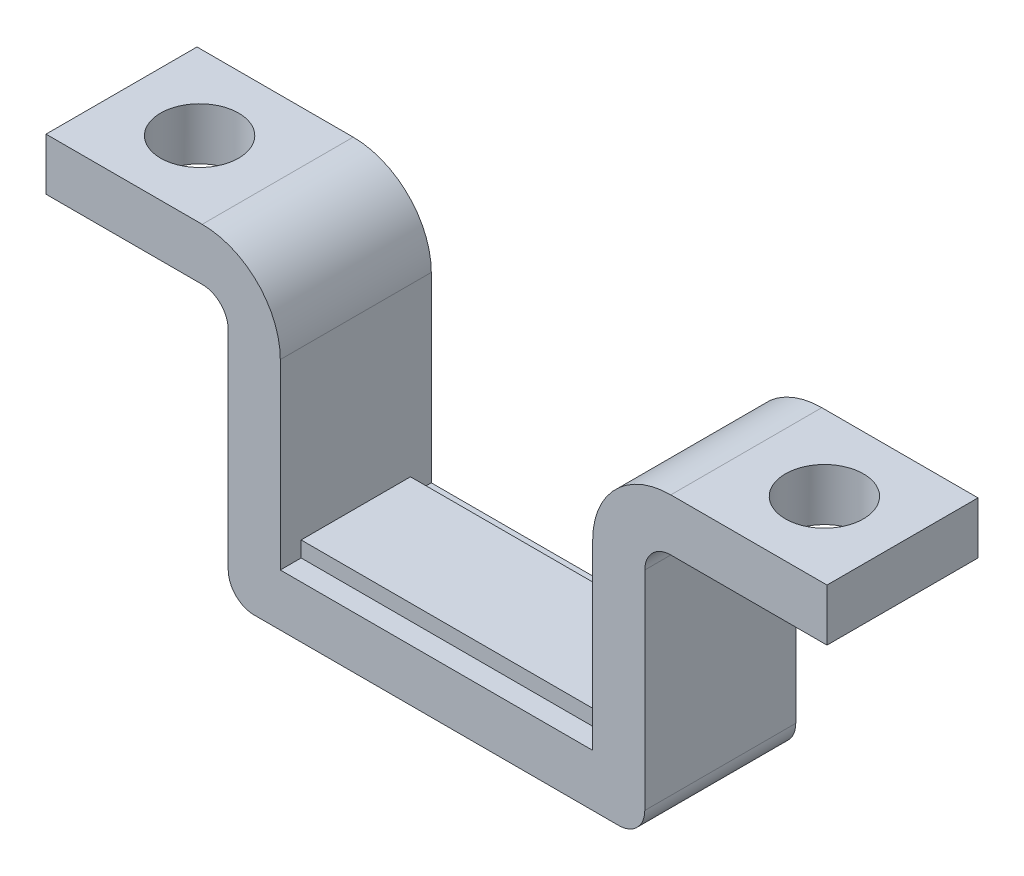
ISO-10303-21;
HEADER;
FILE_DESCRIPTION(('STEP AP214'),'2;1');
FILE_NAME('part.step','',(''),(''),'','','');
FILE_SCHEMA(('AUTOMOTIVE_DESIGN { 1 0 10303 214 1 1 1 1 }'));
ENDSEC;
DATA;
#1=APPLICATION_CONTEXT('core data for automotive mechanical design processes');
#2=APPLICATION_PROTOCOL_DEFINITION('international standard','automotive_design',2000,#1);
#3=PRODUCT_CONTEXT('',#1,'mechanical');
#4=PRODUCT('Part','Part','',(#3));
#5=PRODUCT_RELATED_PRODUCT_CATEGORY('part','',(#4));
#6=PRODUCT_DEFINITION_FORMATION('','',#4);
#7=PRODUCT_DEFINITION_CONTEXT('part definition',#1,'design');
#8=PRODUCT_DEFINITION('design','',#6,#7);
#9=PRODUCT_DEFINITION_SHAPE('','',#8);
#10=(LENGTH_UNIT() NAMED_UNIT(*) SI_UNIT(.MILLI.,.METRE.));
#11=(NAMED_UNIT(*) PLANE_ANGLE_UNIT() SI_UNIT($,.RADIAN.));
#12=(NAMED_UNIT(*) SI_UNIT($,.STERADIAN.) SOLID_ANGLE_UNIT());
#13=UNCERTAINTY_MEASURE_WITH_UNIT(LENGTH_MEASURE(1.E-05),#10,'distance_accuracy_value','');
#14=(GEOMETRIC_REPRESENTATION_CONTEXT(3) GLOBAL_UNCERTAINTY_ASSIGNED_CONTEXT((#13)) GLOBAL_UNIT_ASSIGNED_CONTEXT((#10,
#11,#12)) REPRESENTATION_CONTEXT('',''));
#15=CARTESIAN_POINT('',(0.,0.,0.));
#16=DIRECTION('',(0.,0.,1.));
#17=DIRECTION('',(1.,0.,0.));
#18=AXIS2_PLACEMENT_3D('',#15,#16,#17);
#19=CARTESIAN_POINT('',(-6.,-5.,2.9));
#20=DIRECTION('',(-1.,0.,0.));
#21=DIRECTION('',(0.,0.,1.));
#22=AXIS2_PLACEMENT_3D('',#19,#20,#21);
#23=PLANE('',#22);
#24=DIRECTION('',(0.,-1.,0.));
#25=VECTOR('',#24,1.);
#26=CARTESIAN_POINT('',(-6.,-5.,2.1));
#27=LINE('',#26,#25);
#28=CARTESIAN_POINT('',(-6.,-4.4,2.1));
#29=VERTEX_POINT('',#28);
#30=CARTESIAN_POINT('',(-6.,-5.,2.1));
#31=VERTEX_POINT('',#30);
#32=EDGE_CURVE('E352',#29,#31,#27,.T.);
#33=ORIENTED_EDGE('',*,*,#32,.F.);
#34=DIRECTION('',(0.,0.,-1.));
#35=VECTOR('',#34,1.);
#36=CARTESIAN_POINT('',(-6.,-4.4,2.1));
#37=LINE('',#36,#35);
#38=CARTESIAN_POINT('',(-6.,-4.4,-2.1));
#39=VERTEX_POINT('',#38);
#40=EDGE_CURVE('E360',#29,#39,#37,.T.);
#41=ORIENTED_EDGE('',*,*,#40,.T.);
#42=DIRECTION('',(0.,-1.,0.));
#43=VECTOR('',#42,1.);
#44=CARTESIAN_POINT('',(-6.,-5.,-2.1));
#45=LINE('',#44,#43);
#46=CARTESIAN_POINT('',(-6.,-5.,-2.1));
#47=VERTEX_POINT('',#46);
#48=EDGE_CURVE('E357',#39,#47,#45,.T.);
#49=ORIENTED_EDGE('',*,*,#48,.T.);
#50=DIRECTION('',(0.,0.,-1.));
#51=VECTOR('',#50,1.);
#52=CARTESIAN_POINT('',(-6.,-5.,2.9));
#53=LINE('',#52,#51);
#54=CARTESIAN_POINT('',(-6.,-5.,-2.9));
#55=VERTEX_POINT('',#54);
#56=EDGE_CURVE('E120',#47,#55,#53,.T.);
#57=ORIENTED_EDGE('',*,*,#56,.T.);
#58=DIRECTION('',(0.,1.,0.));
#59=VECTOR('',#58,1.);
#60=CARTESIAN_POINT('',(-6.,-5.,-2.9));
#61=LINE('',#60,#59);
#62=CARTESIAN_POINT('',(-6.,2.,-2.9));
#63=VERTEX_POINT('',#62);
#64=EDGE_CURVE('E204',#55,#63,#61,.T.);
#65=ORIENTED_EDGE('',*,*,#64,.T.);
#66=DIRECTION('',(0.,0.,-1.));
#67=VECTOR('',#66,1.);
#68=CARTESIAN_POINT('',(-6.,2.,2.9));
#69=LINE('',#68,#67);
#70=CARTESIAN_POINT('',(-6.,2.,2.9));
#71=VERTEX_POINT('',#70);
#72=EDGE_CURVE('E11',#71,#63,#69,.T.);
#73=ORIENTED_EDGE('',*,*,#72,.F.);
#74=DIRECTION('',(0.,1.,0.));
#75=VECTOR('',#74,1.);
#76=CARTESIAN_POINT('',(-6.,-5.,2.9));
#77=LINE('',#76,#75);
#78=CARTESIAN_POINT('',(-6.,-5.,2.9));
#79=VERTEX_POINT('',#78);
#80=EDGE_CURVE('E240',#79,#71,#77,.T.);
#81=ORIENTED_EDGE('',*,*,#80,.F.);
#82=EDGE_CURVE('E241',#79,#31,#53,.T.);
#83=ORIENTED_EDGE('',*,*,#82,.T.);
#84=EDGE_LOOP('',(#33,#41,#49,#57,#65,#73,#81,#83));
#85=FACE_BOUND('',#84,.T.);
#86=ADVANCED_FACE('F32',(#85),#23,.F.);
#87=CARTESIAN_POINT('',(6.,-5.,2.9));
#88=DIRECTION('',(1.,0.,0.));
#89=DIRECTION('',(0.,0.,-1.));
#90=AXIS2_PLACEMENT_3D('',#87,#88,#89);
#91=PLANE('',#90);
#92=DIRECTION('',(0.,1.,0.));
#93=VECTOR('',#92,1.);
#94=CARTESIAN_POINT('',(6.,-4.4,2.1));
#95=LINE('',#94,#93);
#96=CARTESIAN_POINT('',(6.,-5.,2.1));
#97=VERTEX_POINT('',#96);
#98=CARTESIAN_POINT('',(6.,-4.4,2.1));
#99=VERTEX_POINT('',#98);
#100=EDGE_CURVE('E619',#97,#99,#95,.T.);
#101=ORIENTED_EDGE('',*,*,#100,.F.);
#102=DIRECTION('',(0.,0.,-1.));
#103=VECTOR('',#102,1.);
#104=CARTESIAN_POINT('',(6.,-5.,2.9));
#105=LINE('',#104,#103);
#106=CARTESIAN_POINT('',(6.,-5.,2.9));
#107=VERTEX_POINT('',#106);
#108=EDGE_CURVE('E195',#107,#97,#105,.T.);
#109=ORIENTED_EDGE('',*,*,#108,.F.);
#110=DIRECTION('',(0.,-1.,0.));
#111=VECTOR('',#110,1.);
#112=CARTESIAN_POINT('',(6.,-5.,2.9));
#113=LINE('',#112,#111);
#114=CARTESIAN_POINT('',(6.,2.,2.9));
#115=VERTEX_POINT('',#114);
#116=EDGE_CURVE('E178',#115,#107,#113,.T.);
#117=ORIENTED_EDGE('',*,*,#116,.F.);
#118=DIRECTION('',(0.,0.,-1.));
#119=VECTOR('',#118,1.);
#120=CARTESIAN_POINT('',(6.,2.,2.9));
#121=LINE('',#120,#119);
#122=CARTESIAN_POINT('',(6.,2.,-2.9));
#123=VERTEX_POINT('',#122);
#124=EDGE_CURVE('E187',#115,#123,#121,.T.);
#125=ORIENTED_EDGE('',*,*,#124,.T.);
#126=DIRECTION('',(0.,-1.,0.));
#127=VECTOR('',#126,1.);
#128=CARTESIAN_POINT('',(6.,-5.,-2.9));
#129=LINE('',#128,#127);
#130=CARTESIAN_POINT('',(6.,-5.,-2.9));
#131=VERTEX_POINT('',#130);
#132=EDGE_CURVE('E236',#123,#131,#129,.T.);
#133=ORIENTED_EDGE('',*,*,#132,.T.);
#134=CARTESIAN_POINT('',(6.,-5.,-2.1));
#135=VERTEX_POINT('',#134);
#136=EDGE_CURVE('E244',#135,#131,#105,.T.);
#137=ORIENTED_EDGE('',*,*,#136,.F.);
#138=DIRECTION('',(0.,1.,0.));
#139=VECTOR('',#138,1.);
#140=CARTESIAN_POINT('',(6.,-4.4,-2.1));
#141=LINE('',#140,#139);
#142=CARTESIAN_POINT('',(6.,-4.4,-2.1));
#143=VERTEX_POINT('',#142);
#144=EDGE_CURVE('E47',#135,#143,#141,.T.);
#145=ORIENTED_EDGE('',*,*,#144,.T.);
#146=DIRECTION('',(0.,0.,-1.));
#147=VECTOR('',#146,1.);
#148=CARTESIAN_POINT('',(6.,-4.4,2.1));
#149=LINE('',#148,#147);
#150=EDGE_CURVE('E207',#99,#143,#149,.T.);
#151=ORIENTED_EDGE('',*,*,#150,.F.);
#152=EDGE_LOOP('',(#101,#109,#117,#125,#133,#137,#145,#151));
#153=FACE_BOUND('',#152,.T.);
#154=ADVANCED_FACE('F198',(#153),#91,.F.);
#155=CARTESIAN_POINT('',(-6.,-5.,2.9));
#156=DIRECTION('',(0.,-1.,0.));
#157=DIRECTION('',(1.,0.,0.));
#158=AXIS2_PLACEMENT_3D('',#155,#156,#157);
#159=PLANE('',#158);
#160=DIRECTION('',(1.,0.,0.));
#161=VECTOR('',#160,1.);
#162=CARTESIAN_POINT('',(-6.,-5.,2.1));
#163=LINE('',#162,#161);
#164=EDGE_CURVE('E359',#31,#97,#163,.T.);
#165=ORIENTED_EDGE('',*,*,#164,.F.);
#166=ORIENTED_EDGE('',*,*,#82,.F.);
#167=DIRECTION('',(-1.,0.,0.));
#168=VECTOR('',#167,1.);
#169=CARTESIAN_POINT('',(-6.,-5.,2.9));
#170=LINE('',#169,#168);
#171=EDGE_CURVE('E56',#107,#79,#170,.T.);
#172=ORIENTED_EDGE('',*,*,#171,.F.);
#173=ORIENTED_EDGE('',*,*,#108,.T.);
#174=EDGE_LOOP('',(#165,#166,#172,#173));
#175=FACE_BOUND('',#174,.T.);
#176=ADVANCED_FACE('F371',(#175),#159,.F.);
#177=CARTESIAN_POINT('',(-9.00000000000001,2.,2.9));
#178=DIRECTION('',(0.,0.,-1.));
#179=DIRECTION('',(-1.,0.,0.));
#180=AXIS2_PLACEMENT_3D('',#177,#178,#179);
#181=CYLINDRICAL_SURFACE('',#180,3.);
#182=CARTESIAN_POINT('',(-9.00000000000001,2.,-2.9));
#183=DIRECTION('',(0.,0.,1.));
#184=DIRECTION('',(1.,0.,0.));
#185=AXIS2_PLACEMENT_3D('',#182,#183,#184);
#186=CIRCLE('',#185,3.);
#187=CARTESIAN_POINT('',(-9.00000000000001,5.,-2.9));
#188=VERTEX_POINT('',#187);
#189=EDGE_CURVE('E206',#63,#188,#186,.T.);
#190=ORIENTED_EDGE('',*,*,#189,.T.);
#191=DIRECTION('',(0.,0.,-1.));
#192=VECTOR('',#191,1.);
#193=CARTESIAN_POINT('',(-9.00000000000001,5.,2.9));
#194=LINE('',#193,#192);
#195=CARTESIAN_POINT('',(-9.00000000000001,5.,2.9));
#196=VERTEX_POINT('',#195);
#197=EDGE_CURVE('E40',#196,#188,#194,.T.);
#198=ORIENTED_EDGE('',*,*,#197,.F.);
#199=CARTESIAN_POINT('',(-9.00000000000001,2.,2.9));
#200=DIRECTION('',(0.,0.,1.));
#201=DIRECTION('',(1.,0.,0.));
#202=AXIS2_PLACEMENT_3D('',#199,#200,#201);
#203=CIRCLE('',#202,3.);
#204=EDGE_CURVE('E128',#71,#196,#203,.T.);
#205=ORIENTED_EDGE('',*,*,#204,.F.);
#206=ORIENTED_EDGE('',*,*,#72,.T.);
#207=EDGE_LOOP('',(#190,#198,#205,#206));
#208=FACE_BOUND('',#207,.T.);
#209=ADVANCED_FACE('F369',(#208),#181,.T.);
#210=CARTESIAN_POINT('',(-15.,5.,2.9));
#211=DIRECTION('',(0.,-1.,0.));
#212=DIRECTION('',(0.,0.,-1.));
#213=AXIS2_PLACEMENT_3D('',#210,#211,#212);
#214=PLANE('',#213);
#215=CARTESIAN_POINT('',(-12.,5.,0.));
#216=DIRECTION('',(0.,1.,0.));
#217=DIRECTION('',(0.,0.,1.));
#218=AXIS2_PLACEMENT_3D('',#215,#216,#217);
#219=CIRCLE('',#218,1.5);
#220=CARTESIAN_POINT('',(-12.,5.,1.5));
#221=VERTEX_POINT('',#220);
#222=EDGE_CURVE('E608',#221,#221,#219,.T.);
#223=ORIENTED_EDGE('',*,*,#222,.F.);
#224=EDGE_LOOP('',(#223));
#225=FACE_BOUND('',#224,.T.);
#226=DIRECTION('',(-1.,0.,0.));
#227=VECTOR('',#226,1.);
#228=CARTESIAN_POINT('',(-15.,5.,-2.9));
#229=LINE('',#228,#227);
#230=CARTESIAN_POINT('',(-15.,5.,-2.9));
#231=VERTEX_POINT('',#230);
#232=EDGE_CURVE('E209',#188,#231,#229,.T.);
#233=ORIENTED_EDGE('',*,*,#232,.T.);
#234=DIRECTION('',(0.,0.,-1.));
#235=VECTOR('',#234,1.);
#236=CARTESIAN_POINT('',(-15.,5.,2.9));
#237=LINE('',#236,#235);
#238=CARTESIAN_POINT('',(-15.,5.,2.9));
#239=VERTEX_POINT('',#238);
#240=EDGE_CURVE('E280',#239,#231,#237,.T.);
#241=ORIENTED_EDGE('',*,*,#240,.F.);
#242=DIRECTION('',(-1.,0.,0.));
#243=VECTOR('',#242,1.);
#244=CARTESIAN_POINT('',(-15.,5.,2.9));
#245=LINE('',#244,#243);
#246=EDGE_CURVE('E289',#196,#239,#245,.T.);
#247=ORIENTED_EDGE('',*,*,#246,.F.);
#248=ORIENTED_EDGE('',*,*,#197,.T.);
#249=EDGE_LOOP('',(#233,#241,#247,#248));
#250=FACE_BOUND('',#249,.T.);
#251=ADVANCED_FACE('F287',(#225,#250),#214,.F.);
#252=CARTESIAN_POINT('',(-15.,3.,2.9));
#253=DIRECTION('',(1.,0.,0.));
#254=DIRECTION('',(0.,0.,-1.));
#255=AXIS2_PLACEMENT_3D('',#252,#253,#254);
#256=PLANE('',#255);
#257=DIRECTION('',(0.,-1.,0.));
#258=VECTOR('',#257,1.);
#259=CARTESIAN_POINT('',(-15.,3.,-2.9));
#260=LINE('',#259,#258);
#261=CARTESIAN_POINT('',(-15.,3.,-2.9));
#262=VERTEX_POINT('',#261);
#263=EDGE_CURVE('E211',#231,#262,#260,.T.);
#264=ORIENTED_EDGE('',*,*,#263,.T.);
#265=DIRECTION('',(0.,0.,-1.));
#266=VECTOR('',#265,1.);
#267=CARTESIAN_POINT('',(-15.,3.,2.9));
#268=LINE('',#267,#266);
#269=CARTESIAN_POINT('',(-15.,3.,2.9));
#270=VERTEX_POINT('',#269);
#271=EDGE_CURVE('E277',#270,#262,#268,.T.);
#272=ORIENTED_EDGE('',*,*,#271,.F.);
#273=DIRECTION('',(0.,-1.,0.));
#274=VECTOR('',#273,1.);
#275=CARTESIAN_POINT('',(-15.,3.,2.9));
#276=LINE('',#275,#274);
#277=EDGE_CURVE('E307',#239,#270,#276,.T.);
#278=ORIENTED_EDGE('',*,*,#277,.F.);
#279=ORIENTED_EDGE('',*,*,#240,.T.);
#280=EDGE_LOOP('',(#264,#272,#278,#279));
#281=FACE_BOUND('',#280,.T.);
#282=ADVANCED_FACE('F298',(#281),#256,.F.);
#283=CARTESIAN_POINT('',(-9.00000000000001,3.,2.9));
#284=DIRECTION('',(0.,1.,0.));
#285=DIRECTION('',(-1.,0.,0.));
#286=AXIS2_PLACEMENT_3D('',#283,#284,#285);
#287=PLANE('',#286);
#288=CARTESIAN_POINT('',(-12.,3.,0.));
#289=DIRECTION('',(0.,1.,0.));
#290=DIRECTION('',(-1.,0.,0.));
#291=AXIS2_PLACEMENT_3D('',#288,#289,#290);
#292=CIRCLE('',#291,1.5);
#293=CARTESIAN_POINT('',(-13.5,3.,0.));
#294=VERTEX_POINT('',#293);
#295=EDGE_CURVE('E35',#294,#294,#292,.T.);
#296=ORIENTED_EDGE('',*,*,#295,.T.);
#297=EDGE_LOOP('',(#296));
#298=FACE_BOUND('',#297,.T.);
#299=DIRECTION('',(1.,0.,0.));
#300=VECTOR('',#299,1.);
#301=CARTESIAN_POINT('',(-9.00000000000001,3.,-2.9));
#302=LINE('',#301,#300);
#303=CARTESIAN_POINT('',(-9.00000000000001,3.,-2.9));
#304=VERTEX_POINT('',#303);
#305=EDGE_CURVE('E213',#262,#304,#302,.T.);
#306=ORIENTED_EDGE('',*,*,#305,.T.);
#307=DIRECTION('',(0.,0.,-1.));
#308=VECTOR('',#307,1.);
#309=CARTESIAN_POINT('',(-9.00000000000001,3.,2.9));
#310=LINE('',#309,#308);
#311=CARTESIAN_POINT('',(-9.00000000000001,3.,2.9));
#312=VERTEX_POINT('',#311);
#313=EDGE_CURVE('E274',#312,#304,#310,.T.);
#314=ORIENTED_EDGE('',*,*,#313,.F.);
#315=DIRECTION('',(1.,0.,0.));
#316=VECTOR('',#315,1.);
#317=CARTESIAN_POINT('',(-9.00000000000001,3.,2.9));
#318=LINE('',#317,#316);
#319=EDGE_CURVE('E304',#270,#312,#318,.T.);
#320=ORIENTED_EDGE('',*,*,#319,.F.);
#321=ORIENTED_EDGE('',*,*,#271,.T.);
#322=EDGE_LOOP('',(#306,#314,#320,#321));
#323=FACE_BOUND('',#322,.T.);
#324=ADVANCED_FACE('F302',(#298,#323),#287,.F.);
#325=CARTESIAN_POINT('',(-9.00000000000001,2.,2.9));
#326=DIRECTION('',(0.,0.,-1.));
#327=DIRECTION('',(-1.,0.,0.));
#328=AXIS2_PLACEMENT_3D('',#325,#326,#327);
#329=CYLINDRICAL_SURFACE('',#328,1.);
#330=CARTESIAN_POINT('',(-9.00000000000001,2.,-2.9));
#331=DIRECTION('',(0.,0.,-1.));
#332=DIRECTION('',(1.,0.,0.));
#333=AXIS2_PLACEMENT_3D('',#330,#331,#332);
#334=CIRCLE('',#333,1.);
#335=CARTESIAN_POINT('',(-8.,2.,-2.9));
#336=VERTEX_POINT('',#335);
#337=EDGE_CURVE('E215',#304,#336,#334,.T.);
#338=ORIENTED_EDGE('',*,*,#337,.T.);
#339=DIRECTION('',(0.,0.,-1.));
#340=VECTOR('',#339,1.);
#341=CARTESIAN_POINT('',(-8.,2.,2.9));
#342=LINE('',#341,#340);
#343=CARTESIAN_POINT('',(-8.,2.,2.9));
#344=VERTEX_POINT('',#343);
#345=EDGE_CURVE('E271',#344,#336,#342,.T.);
#346=ORIENTED_EDGE('',*,*,#345,.F.);
#347=CARTESIAN_POINT('',(-9.00000000000001,2.,2.9));
#348=DIRECTION('',(0.,0.,-1.));
#349=DIRECTION('',(1.,0.,0.));
#350=AXIS2_PLACEMENT_3D('',#347,#348,#349);
#351=CIRCLE('',#350,1.);
#352=EDGE_CURVE('E306',#312,#344,#351,.T.);
#353=ORIENTED_EDGE('',*,*,#352,.F.);
#354=ORIENTED_EDGE('',*,*,#313,.T.);
#355=EDGE_LOOP('',(#338,#346,#353,#354));
#356=FACE_BOUND('',#355,.T.);
#357=ADVANCED_FACE('F423',(#356),#329,.F.);
#358=CARTESIAN_POINT('',(-8.,-5.99999999999999,2.9));
#359=DIRECTION('',(1.,0.,0.));
#360=DIRECTION('',(0.,0.,-1.));
#361=AXIS2_PLACEMENT_3D('',#358,#359,#360);
#362=PLANE('',#361);
#363=DIRECTION('',(0.,-1.,0.));
#364=VECTOR('',#363,1.);
#365=CARTESIAN_POINT('',(-8.,-5.99999999999999,-2.9));
#366=LINE('',#365,#364);
#367=CARTESIAN_POINT('',(-8.,-6.,-2.9));
#368=VERTEX_POINT('',#367);
#369=EDGE_CURVE('E217',#336,#368,#366,.T.);
#370=ORIENTED_EDGE('',*,*,#369,.T.);
#371=DIRECTION('',(0.,0.,-1.));
#372=VECTOR('',#371,1.);
#373=CARTESIAN_POINT('',(-8.,-6.,2.9));
#374=LINE('',#373,#372);
#375=CARTESIAN_POINT('',(-8.,-6.,2.9));
#376=VERTEX_POINT('',#375);
#377=EDGE_CURVE('E268',#376,#368,#374,.T.);
#378=ORIENTED_EDGE('',*,*,#377,.F.);
#379=DIRECTION('',(0.,-1.,0.));
#380=VECTOR('',#379,1.);
#381=CARTESIAN_POINT('',(-8.,-5.99999999999999,2.9));
#382=LINE('',#381,#380);
#383=EDGE_CURVE('E309',#344,#376,#382,.T.);
#384=ORIENTED_EDGE('',*,*,#383,.F.);
#385=ORIENTED_EDGE('',*,*,#345,.T.);
#386=EDGE_LOOP('',(#370,#378,#384,#385));
#387=FACE_BOUND('',#386,.T.);
#388=ADVANCED_FACE('F419',(#387),#362,.F.);
#389=CARTESIAN_POINT('',(-7.,-6.,2.9));
#390=DIRECTION('',(0.,0.,-1.));
#391=DIRECTION('',(-1.,0.,0.));
#392=AXIS2_PLACEMENT_3D('',#389,#390,#391);
#393=CYLINDRICAL_SURFACE('',#392,1.);
#394=CARTESIAN_POINT('',(-7.,-6.,-2.9));
#395=DIRECTION('',(0.,0.,1.));
#396=DIRECTION('',(-1.,0.,0.));
#397=AXIS2_PLACEMENT_3D('',#394,#395,#396);
#398=CIRCLE('',#397,1.);
#399=CARTESIAN_POINT('',(-7.,-7.,-2.9));
#400=VERTEX_POINT('',#399);
#401=EDGE_CURVE('E219',#368,#400,#398,.T.);
#402=ORIENTED_EDGE('',*,*,#401,.T.);
#403=DIRECTION('',(0.,0.,-1.));
#404=VECTOR('',#403,1.);
#405=CARTESIAN_POINT('',(-7.,-7.,2.9));
#406=LINE('',#405,#404);
#407=CARTESIAN_POINT('',(-7.,-7.,2.9));
#408=VERTEX_POINT('',#407);
#409=EDGE_CURVE('E265',#408,#400,#406,.T.);
#410=ORIENTED_EDGE('',*,*,#409,.F.);
#411=CARTESIAN_POINT('',(-7.,-6.,2.9));
#412=DIRECTION('',(0.,0.,1.));
#413=DIRECTION('',(-1.,0.,0.));
#414=AXIS2_PLACEMENT_3D('',#411,#412,#413);
#415=CIRCLE('',#414,1.);
#416=EDGE_CURVE('E315',#376,#408,#415,.T.);
#417=ORIENTED_EDGE('',*,*,#416,.F.);
#418=ORIENTED_EDGE('',*,*,#377,.T.);
#419=EDGE_LOOP('',(#402,#410,#417,#418));
#420=FACE_BOUND('',#419,.T.);
#421=ADVANCED_FACE('F415',(#420),#393,.T.);
#422=CARTESIAN_POINT('',(-7.,-7.,2.9));
#423=DIRECTION('',(0.,1.,0.));
#424=DIRECTION('',(0.,0.,1.));
#425=AXIS2_PLACEMENT_3D('',#422,#423,#424);
#426=PLANE('',#425);
#427=DIRECTION('',(1.,0.,0.));
#428=VECTOR('',#427,1.);
#429=CARTESIAN_POINT('',(-7.,-7.,-2.9));
#430=LINE('',#429,#428);
#431=CARTESIAN_POINT('',(7.,-7.,-2.9));
#432=VERTEX_POINT('',#431);
#433=EDGE_CURVE('E221',#400,#432,#430,.T.);
#434=ORIENTED_EDGE('',*,*,#433,.T.);
#435=DIRECTION('',(0.,0.,-1.));
#436=VECTOR('',#435,1.);
#437=CARTESIAN_POINT('',(7.,-7.,2.9));
#438=LINE('',#437,#436);
#439=CARTESIAN_POINT('',(7.,-7.,2.9));
#440=VERTEX_POINT('',#439);
#441=EDGE_CURVE('E262',#440,#432,#438,.T.);
#442=ORIENTED_EDGE('',*,*,#441,.F.);
#443=DIRECTION('',(1.,0.,0.));
#444=VECTOR('',#443,1.);
#445=CARTESIAN_POINT('',(-7.,-7.,2.9));
#446=LINE('',#445,#444);
#447=EDGE_CURVE('E317',#408,#440,#446,.T.);
#448=ORIENTED_EDGE('',*,*,#447,.F.);
#449=ORIENTED_EDGE('',*,*,#409,.T.);
#450=EDGE_LOOP('',(#434,#442,#448,#449));
#451=FACE_BOUND('',#450,.T.);
#452=ADVANCED_FACE('F411',(#451),#426,.F.);
#453=CARTESIAN_POINT('',(7.,-6.,2.9));
#454=DIRECTION('',(0.,0.,-1.));
#455=DIRECTION('',(-1.,0.,0.));
#456=AXIS2_PLACEMENT_3D('',#453,#454,#455);
#457=CYLINDRICAL_SURFACE('',#456,1.);
#458=CARTESIAN_POINT('',(7.,-6.,-2.9));
#459=DIRECTION('',(0.,0.,1.));
#460=DIRECTION('',(-1.,0.,0.));
#461=AXIS2_PLACEMENT_3D('',#458,#459,#460);
#462=CIRCLE('',#461,1.);
#463=CARTESIAN_POINT('',(8.,-5.99999999999999,-2.9));
#464=VERTEX_POINT('',#463);
#465=EDGE_CURVE('E223',#432,#464,#462,.T.);
#466=ORIENTED_EDGE('',*,*,#465,.T.);
#467=DIRECTION('',(0.,0.,-1.));
#468=VECTOR('',#467,1.);
#469=CARTESIAN_POINT('',(8.,-5.99999999999999,2.9));
#470=LINE('',#469,#468);
#471=CARTESIAN_POINT('',(8.,-5.99999999999999,2.9));
#472=VERTEX_POINT('',#471);
#473=EDGE_CURVE('E259',#472,#464,#470,.T.);
#474=ORIENTED_EDGE('',*,*,#473,.F.);
#475=CARTESIAN_POINT('',(7.,-6.,2.9));
#476=DIRECTION('',(0.,0.,1.));
#477=DIRECTION('',(-1.,0.,0.));
#478=AXIS2_PLACEMENT_3D('',#475,#476,#477);
#479=CIRCLE('',#478,1.);
#480=EDGE_CURVE('E319',#440,#472,#479,.T.);
#481=ORIENTED_EDGE('',*,*,#480,.F.);
#482=ORIENTED_EDGE('',*,*,#441,.T.);
#483=EDGE_LOOP('',(#466,#474,#481,#482));
#484=FACE_BOUND('',#483,.T.);
#485=ADVANCED_FACE('F407',(#484),#457,.T.);
#486=CARTESIAN_POINT('',(8.,-5.99999999999999,2.9));
#487=DIRECTION('',(-1.,0.,0.));
#488=DIRECTION('',(0.,0.,1.));
#489=AXIS2_PLACEMENT_3D('',#486,#487,#488);
#490=PLANE('',#489);
#491=DIRECTION('',(0.,1.,0.));
#492=VECTOR('',#491,1.);
#493=CARTESIAN_POINT('',(8.,-5.99999999999999,-2.9));
#494=LINE('',#493,#492);
#495=CARTESIAN_POINT('',(8.,2.,-2.9));
#496=VERTEX_POINT('',#495);
#497=EDGE_CURVE('E225',#464,#496,#494,.T.);
#498=ORIENTED_EDGE('',*,*,#497,.T.);
#499=DIRECTION('',(0.,0.,-1.));
#500=VECTOR('',#499,1.);
#501=CARTESIAN_POINT('',(8.,2.,2.9));
#502=LINE('',#501,#500);
#503=CARTESIAN_POINT('',(8.,2.,2.9));
#504=VERTEX_POINT('',#503);
#505=EDGE_CURVE('E256',#504,#496,#502,.T.);
#506=ORIENTED_EDGE('',*,*,#505,.F.);
#507=DIRECTION('',(0.,1.,0.));
#508=VECTOR('',#507,1.);
#509=CARTESIAN_POINT('',(8.,-5.99999999999999,2.9));
#510=LINE('',#509,#508);
#511=EDGE_CURVE('E321',#472,#504,#510,.T.);
#512=ORIENTED_EDGE('',*,*,#511,.F.);
#513=ORIENTED_EDGE('',*,*,#473,.T.);
#514=EDGE_LOOP('',(#498,#506,#512,#513));
#515=FACE_BOUND('',#514,.T.);
#516=ADVANCED_FACE('F403',(#515),#490,.F.);
#517=CARTESIAN_POINT('',(9.00000000000001,2.,2.9));
#518=DIRECTION('',(0.,0.,-1.));
#519=DIRECTION('',(-1.,0.,0.));
#520=AXIS2_PLACEMENT_3D('',#517,#518,#519);
#521=CYLINDRICAL_SURFACE('',#520,1.);
#522=CARTESIAN_POINT('',(9.00000000000001,2.,-2.9));
#523=DIRECTION('',(0.,0.,-1.));
#524=DIRECTION('',(1.,0.,0.));
#525=AXIS2_PLACEMENT_3D('',#522,#523,#524);
#526=CIRCLE('',#525,1.);
#527=CARTESIAN_POINT('',(9.00000000000001,3.,-2.9));
#528=VERTEX_POINT('',#527);
#529=EDGE_CURVE('E227',#496,#528,#526,.T.);
#530=ORIENTED_EDGE('',*,*,#529,.T.);
#531=DIRECTION('',(0.,0.,-1.));
#532=VECTOR('',#531,1.);
#533=CARTESIAN_POINT('',(9.00000000000001,3.,2.9));
#534=LINE('',#533,#532);
#535=CARTESIAN_POINT('',(9.00000000000001,3.,2.9));
#536=VERTEX_POINT('',#535);
#537=EDGE_CURVE('E253',#536,#528,#534,.T.);
#538=ORIENTED_EDGE('',*,*,#537,.F.);
#539=CARTESIAN_POINT('',(9.00000000000001,2.,2.9));
#540=DIRECTION('',(0.,0.,-1.));
#541=DIRECTION('',(1.,0.,0.));
#542=AXIS2_PLACEMENT_3D('',#539,#540,#541);
#543=CIRCLE('',#542,1.);
#544=EDGE_CURVE('E323',#504,#536,#543,.T.);
#545=ORIENTED_EDGE('',*,*,#544,.F.);
#546=ORIENTED_EDGE('',*,*,#505,.T.);
#547=EDGE_LOOP('',(#530,#538,#545,#546));
#548=FACE_BOUND('',#547,.T.);
#549=ADVANCED_FACE('F399',(#548),#521,.F.);
#550=CARTESIAN_POINT('',(15.,3.,2.9));
#551=DIRECTION('',(0.,1.,0.));
#552=DIRECTION('',(-1.,0.,0.));
#553=AXIS2_PLACEMENT_3D('',#550,#551,#552);
#554=PLANE('',#553);
#555=CARTESIAN_POINT('',(12.,3.,0.));
#556=DIRECTION('',(0.,1.,0.));
#557=DIRECTION('',(-1.,0.,0.));
#558=AXIS2_PLACEMENT_3D('',#555,#556,#557);
#559=CIRCLE('',#558,1.5);
#560=CARTESIAN_POINT('',(10.5,3.,0.));
#561=VERTEX_POINT('',#560);
#562=EDGE_CURVE('E350',#561,#561,#559,.T.);
#563=ORIENTED_EDGE('',*,*,#562,.T.);
#564=EDGE_LOOP('',(#563));
#565=FACE_BOUND('',#564,.T.);
#566=DIRECTION('',(1.,0.,0.));
#567=VECTOR('',#566,1.);
#568=CARTESIAN_POINT('',(15.,3.,-2.9));
#569=LINE('',#568,#567);
#570=CARTESIAN_POINT('',(15.,3.,-2.9));
#571=VERTEX_POINT('',#570);
#572=EDGE_CURVE('E229',#528,#571,#569,.T.);
#573=ORIENTED_EDGE('',*,*,#572,.T.);
#574=DIRECTION('',(0.,0.,-1.));
#575=VECTOR('',#574,1.);
#576=CARTESIAN_POINT('',(15.,3.,2.9));
#577=LINE('',#576,#575);
#578=CARTESIAN_POINT('',(15.,3.,2.9));
#579=VERTEX_POINT('',#578);
#580=EDGE_CURVE('E250',#579,#571,#577,.T.);
#581=ORIENTED_EDGE('',*,*,#580,.F.);
#582=DIRECTION('',(1.,0.,0.));
#583=VECTOR('',#582,1.);
#584=CARTESIAN_POINT('',(15.,3.,2.9));
#585=LINE('',#584,#583);
#586=EDGE_CURVE('E325',#536,#579,#585,.T.);
#587=ORIENTED_EDGE('',*,*,#586,.F.);
#588=ORIENTED_EDGE('',*,*,#537,.T.);
#589=EDGE_LOOP('',(#573,#581,#587,#588));
#590=FACE_BOUND('',#589,.T.);
#591=ADVANCED_FACE('F396',(#565,#590),#554,.F.);
#592=CARTESIAN_POINT('',(15.,5.,2.9));
#593=DIRECTION('',(-1.,0.,0.));
#594=DIRECTION('',(0.,-1.,0.));
#595=AXIS2_PLACEMENT_3D('',#592,#593,#594);
#596=PLANE('',#595);
#597=DIRECTION('',(0.,1.,0.));
#598=VECTOR('',#597,1.);
#599=CARTESIAN_POINT('',(15.,5.,-2.9));
#600=LINE('',#599,#598);
#601=CARTESIAN_POINT('',(15.,5.,-2.9));
#602=VERTEX_POINT('',#601);
#603=EDGE_CURVE('E231',#571,#602,#600,.T.);
#604=ORIENTED_EDGE('',*,*,#603,.T.);
#605=DIRECTION('',(0.,0.,-1.));
#606=VECTOR('',#605,1.);
#607=CARTESIAN_POINT('',(15.,5.,2.9));
#608=LINE('',#607,#606);
#609=CARTESIAN_POINT('',(15.,5.,2.9));
#610=VERTEX_POINT('',#609);
#611=EDGE_CURVE('E247',#610,#602,#608,.T.);
#612=ORIENTED_EDGE('',*,*,#611,.F.);
#613=DIRECTION('',(0.,1.,0.));
#614=VECTOR('',#613,1.);
#615=CARTESIAN_POINT('',(15.,5.,2.9));
#616=LINE('',#615,#614);
#617=EDGE_CURVE('E327',#579,#610,#616,.T.);
#618=ORIENTED_EDGE('',*,*,#617,.F.);
#619=ORIENTED_EDGE('',*,*,#580,.T.);
#620=EDGE_LOOP('',(#604,#612,#618,#619));
#621=FACE_BOUND('',#620,.T.);
#622=ADVANCED_FACE('F333',(#621),#596,.F.);
#623=CARTESIAN_POINT('',(9.00000000000001,5.,2.9));
#624=DIRECTION('',(0.,-1.,0.));
#625=DIRECTION('',(0.,0.,-1.));
#626=AXIS2_PLACEMENT_3D('',#623,#624,#625);
#627=PLANE('',#626);
#628=CARTESIAN_POINT('',(12.,5.,0.));
#629=DIRECTION('',(0.,1.,0.));
#630=DIRECTION('',(0.,0.,1.));
#631=AXIS2_PLACEMENT_3D('',#628,#629,#630);
#632=CIRCLE('',#631,1.5);
#633=CARTESIAN_POINT('',(12.,5.,1.5));
#634=VERTEX_POINT('',#633);
#635=EDGE_CURVE('E610',#634,#634,#632,.T.);
#636=ORIENTED_EDGE('',*,*,#635,.F.);
#637=EDGE_LOOP('',(#636));
#638=FACE_BOUND('',#637,.T.);
#639=DIRECTION('',(-1.,0.,0.));
#640=VECTOR('',#639,1.);
#641=CARTESIAN_POINT('',(9.00000000000001,5.,-2.9));
#642=LINE('',#641,#640);
#643=CARTESIAN_POINT('',(9.00000000000001,5.,-2.9));
#644=VERTEX_POINT('',#643);
#645=EDGE_CURVE('E233',#602,#644,#642,.T.);
#646=ORIENTED_EDGE('',*,*,#645,.T.);
#647=DIRECTION('',(0.,0.,-1.));
#648=VECTOR('',#647,1.);
#649=CARTESIAN_POINT('',(9.00000000000001,5.,2.9));
#650=LINE('',#649,#648);
#651=CARTESIAN_POINT('',(9.00000000000001,5.,2.9));
#652=VERTEX_POINT('',#651);
#653=EDGE_CURVE('E194',#652,#644,#650,.T.);
#654=ORIENTED_EDGE('',*,*,#653,.F.);
#655=DIRECTION('',(-1.,0.,0.));
#656=VECTOR('',#655,1.);
#657=CARTESIAN_POINT('',(9.00000000000001,5.,2.9));
#658=LINE('',#657,#656);
#659=EDGE_CURVE('E181',#610,#652,#658,.T.);
#660=ORIENTED_EDGE('',*,*,#659,.F.);
#661=ORIENTED_EDGE('',*,*,#611,.T.);
#662=EDGE_LOOP('',(#646,#654,#660,#661));
#663=FACE_BOUND('',#662,.T.);
#664=ADVANCED_FACE('F337',(#638,#663),#627,.F.);
#665=CARTESIAN_POINT('',(9.00000000000001,2.,2.9));
#666=DIRECTION('',(0.,0.,-1.));
#667=DIRECTION('',(-1.,0.,0.));
#668=AXIS2_PLACEMENT_3D('',#665,#666,#667);
#669=CYLINDRICAL_SURFACE('',#668,3.);
#670=CARTESIAN_POINT('',(9.00000000000001,2.,-2.9));
#671=DIRECTION('',(0.,0.,1.));
#672=DIRECTION('',(1.,0.,0.));
#673=AXIS2_PLACEMENT_3D('',#670,#671,#672);
#674=CIRCLE('',#673,3.);
#675=EDGE_CURVE('E190',#644,#123,#674,.T.);
#676=ORIENTED_EDGE('',*,*,#675,.T.);
#677=ORIENTED_EDGE('',*,*,#124,.F.);
#678=CARTESIAN_POINT('',(9.00000000000001,2.,2.9));
#679=DIRECTION('',(0.,0.,1.));
#680=DIRECTION('',(1.,0.,0.));
#681=AXIS2_PLACEMENT_3D('',#678,#679,#680);
#682=CIRCLE('',#681,3.);
#683=EDGE_CURVE('E174',#652,#115,#682,.T.);
#684=ORIENTED_EDGE('',*,*,#683,.F.);
#685=ORIENTED_EDGE('',*,*,#653,.T.);
#686=EDGE_LOOP('',(#676,#677,#684,#685));
#687=FACE_BOUND('',#686,.T.);
#688=ADVANCED_FACE('F188',(#687),#669,.T.);
#689=ORIENTED_EDGE('',*,*,#56,.F.);
#690=DIRECTION('',(1.,0.,0.));
#691=VECTOR('',#690,1.);
#692=CARTESIAN_POINT('',(-6.,-5.,-2.1));
#693=LINE('',#692,#691);
#694=EDGE_CURVE('E344',#47,#135,#693,.T.);
#695=ORIENTED_EDGE('',*,*,#694,.T.);
#696=ORIENTED_EDGE('',*,*,#136,.T.);
#697=DIRECTION('',(-1.,0.,0.));
#698=VECTOR('',#697,1.);
#699=CARTESIAN_POINT('',(-6.,-5.,-2.9));
#700=LINE('',#699,#698);
#701=EDGE_CURVE('E238',#131,#55,#700,.T.);
#702=ORIENTED_EDGE('',*,*,#701,.T.);
#703=EDGE_LOOP('',(#689,#695,#696,#702));
#704=FACE_BOUND('',#703,.T.);
#705=ADVANCED_FACE('F343',(#704),#159,.F.);
#706=CARTESIAN_POINT('',(-9.00000000000001,2.,2.9));
#707=DIRECTION('',(0.,0.,1.));
#708=DIRECTION('',(1.,0.,0.));
#709=AXIS2_PLACEMENT_3D('',#706,#707,#708);
#710=PLANE('',#709);
#711=ORIENTED_EDGE('',*,*,#80,.T.);
#712=ORIENTED_EDGE('',*,*,#204,.T.);
#713=ORIENTED_EDGE('',*,*,#246,.T.);
#714=ORIENTED_EDGE('',*,*,#277,.T.);
#715=ORIENTED_EDGE('',*,*,#319,.T.);
#716=ORIENTED_EDGE('',*,*,#352,.T.);
#717=ORIENTED_EDGE('',*,*,#383,.T.);
#718=ORIENTED_EDGE('',*,*,#416,.T.);
#719=ORIENTED_EDGE('',*,*,#447,.T.);
#720=ORIENTED_EDGE('',*,*,#480,.T.);
#721=ORIENTED_EDGE('',*,*,#511,.T.);
#722=ORIENTED_EDGE('',*,*,#544,.T.);
#723=ORIENTED_EDGE('',*,*,#586,.T.);
#724=ORIENTED_EDGE('',*,*,#617,.T.);
#725=ORIENTED_EDGE('',*,*,#659,.T.);
#726=ORIENTED_EDGE('',*,*,#683,.T.);
#727=ORIENTED_EDGE('',*,*,#116,.T.);
#728=ORIENTED_EDGE('',*,*,#171,.T.);
#729=EDGE_LOOP('',(#711,#712,#713,#714,#715,#716,#717,#718,#719,#720,#721,#722,#723,#724,#725,
#726,#727,#728));
#730=FACE_BOUND('',#729,.T.);
#731=ADVANCED_FACE('F176',(#730),#710,.T.);
#732=CARTESIAN_POINT('',(-9.00000000000001,2.,-2.9));
#733=DIRECTION('',(0.,0.,1.));
#734=DIRECTION('',(1.,0.,0.));
#735=AXIS2_PLACEMENT_3D('',#732,#733,#734);
#736=PLANE('',#735);
#737=ORIENTED_EDGE('',*,*,#64,.F.);
#738=ORIENTED_EDGE('',*,*,#701,.F.);
#739=ORIENTED_EDGE('',*,*,#132,.F.);
#740=ORIENTED_EDGE('',*,*,#675,.F.);
#741=ORIENTED_EDGE('',*,*,#645,.F.);
#742=ORIENTED_EDGE('',*,*,#603,.F.);
#743=ORIENTED_EDGE('',*,*,#572,.F.);
#744=ORIENTED_EDGE('',*,*,#529,.F.);
#745=ORIENTED_EDGE('',*,*,#497,.F.);
#746=ORIENTED_EDGE('',*,*,#465,.F.);
#747=ORIENTED_EDGE('',*,*,#433,.F.);
#748=ORIENTED_EDGE('',*,*,#401,.F.);
#749=ORIENTED_EDGE('',*,*,#369,.F.);
#750=ORIENTED_EDGE('',*,*,#337,.F.);
#751=ORIENTED_EDGE('',*,*,#305,.F.);
#752=ORIENTED_EDGE('',*,*,#263,.F.);
#753=ORIENTED_EDGE('',*,*,#232,.F.);
#754=ORIENTED_EDGE('',*,*,#189,.F.);
#755=EDGE_LOOP('',(#737,#738,#739,#740,#741,#742,#743,#744,#745,#746,#747,#748,#749,#750,#751,
#752,#753,#754));
#756=FACE_BOUND('',#755,.T.);
#757=ADVANCED_FACE('F293',(#756),#736,.F.);
#758=CARTESIAN_POINT('',(-6.,-4.4,2.1));
#759=DIRECTION('',(0.,-1.,0.));
#760=DIRECTION('',(0.,0.,-1.));
#761=AXIS2_PLACEMENT_3D('',#758,#759,#760);
#762=PLANE('',#761);
#763=DIRECTION('',(-1.,0.,0.));
#764=VECTOR('',#763,1.);
#765=CARTESIAN_POINT('',(-6.,-4.4,-2.1));
#766=LINE('',#765,#764);
#767=EDGE_CURVE('E347',#143,#39,#766,.T.);
#768=ORIENTED_EDGE('',*,*,#767,.T.);
#769=ORIENTED_EDGE('',*,*,#40,.F.);
#770=DIRECTION('',(-1.,0.,0.));
#771=VECTOR('',#770,1.);
#772=CARTESIAN_POINT('',(-6.,-4.4,2.1));
#773=LINE('',#772,#771);
#774=EDGE_CURVE('E621',#99,#29,#773,.T.);
#775=ORIENTED_EDGE('',*,*,#774,.F.);
#776=ORIENTED_EDGE('',*,*,#150,.T.);
#777=EDGE_LOOP('',(#768,#769,#775,#776));
#778=FACE_BOUND('',#777,.T.);
#779=ADVANCED_FACE('F504',(#778),#762,.F.);
#780=CARTESIAN_POINT('',(0.,0.,2.1));
#781=DIRECTION('',(0.,0.,-1.));
#782=DIRECTION('',(-1.,0.,0.));
#783=AXIS2_PLACEMENT_3D('',#780,#781,#782);
#784=PLANE('',#783);
#785=ORIENTED_EDGE('',*,*,#164,.T.);
#786=ORIENTED_EDGE('',*,*,#100,.T.);
#787=ORIENTED_EDGE('',*,*,#774,.T.);
#788=ORIENTED_EDGE('',*,*,#32,.T.);
#789=EDGE_LOOP('',(#785,#786,#787,#788));
#790=FACE_BOUND('',#789,.T.);
#791=ADVANCED_FACE('F509',(#790),#784,.F.);
#792=CARTESIAN_POINT('',(0.,0.,-2.1));
#793=DIRECTION('',(0.,0.,-1.));
#794=DIRECTION('',(-1.,0.,0.));
#795=AXIS2_PLACEMENT_3D('',#792,#793,#794);
#796=PLANE('',#795);
#797=ORIENTED_EDGE('',*,*,#694,.F.);
#798=ORIENTED_EDGE('',*,*,#48,.F.);
#799=ORIENTED_EDGE('',*,*,#767,.F.);
#800=ORIENTED_EDGE('',*,*,#144,.F.);
#801=EDGE_LOOP('',(#797,#798,#799,#800));
#802=FACE_BOUND('',#801,.T.);
#803=ADVANCED_FACE('F517',(#802),#796,.T.);
#804=CARTESIAN_POINT('',(12.,-7.,0.));
#805=DIRECTION('',(0.,1.,0.));
#806=DIRECTION('',(0.,0.,1.));
#807=AXIS2_PLACEMENT_3D('',#804,#805,#806);
#808=CYLINDRICAL_SURFACE('',#807,1.5);
#809=ORIENTED_EDGE('',*,*,#635,.T.);
#810=EDGE_LOOP('',(#809));
#811=FACE_BOUND('',#810,.T.);
#812=ORIENTED_EDGE('',*,*,#562,.F.);
#813=EDGE_LOOP('',(#812));
#814=FACE_BOUND('',#813,.T.);
#815=ADVANCED_FACE('F525',(#811,#814),#808,.F.);
#816=CARTESIAN_POINT('',(-12.,-7.,0.));
#817=DIRECTION('',(0.,1.,0.));
#818=DIRECTION('',(0.,0.,1.));
#819=AXIS2_PLACEMENT_3D('',#816,#817,#818);
#820=CYLINDRICAL_SURFACE('',#819,1.5);
#821=ORIENTED_EDGE('',*,*,#222,.T.);
#822=EDGE_LOOP('',(#821));
#823=FACE_BOUND('',#822,.T.);
#824=ORIENTED_EDGE('',*,*,#295,.F.);
#825=EDGE_LOOP('',(#824));
#826=FACE_BOUND('',#825,.T.);
#827=ADVANCED_FACE('F531',(#823,#826),#820,.F.);
#828=CLOSED_SHELL('',(#86,#154,#176,#209,#251,#282,#324,#357,#388,#421,#452,#485,#516,#549,#591,
#622,#664,#688,#705,#731,#757,#779,#791,#803,#815,#827));
#829=MANIFOLD_SOLID_BREP('B2',#828);
#830=ADVANCED_BREP_SHAPE_REPRESENTATION('',(#18,#829),#14);
#831=SHAPE_DEFINITION_REPRESENTATION(#9,#830);
ENDSEC;
END-ISO-10303-21;
